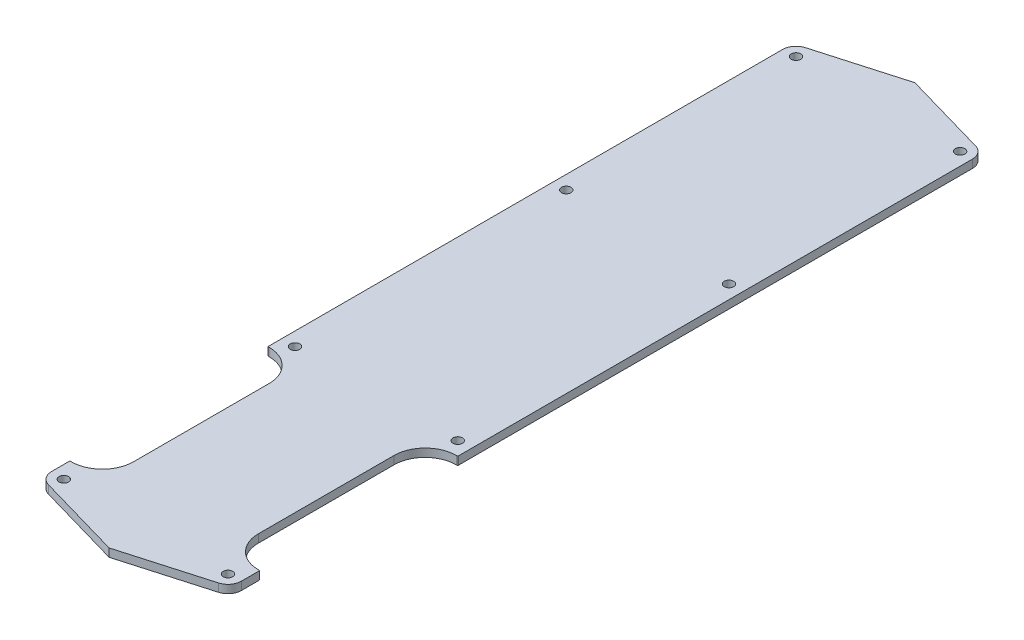
ISO-10303-21;
HEADER;
FILE_DESCRIPTION(('STEP AP214'),'2;1');
FILE_NAME('part.step','',(''),(''),'','','');
FILE_SCHEMA(('AUTOMOTIVE_DESIGN { 1 0 10303 214 1 1 1 1 }'));
ENDSEC;
DATA;
#1=APPLICATION_CONTEXT('core data for automotive mechanical design processes');
#2=APPLICATION_PROTOCOL_DEFINITION('international standard','automotive_design',2000,#1);
#3=PRODUCT_CONTEXT('',#1,'mechanical');
#4=PRODUCT('Part','Part','',(#3));
#5=PRODUCT_RELATED_PRODUCT_CATEGORY('part','',(#4));
#6=PRODUCT_DEFINITION_FORMATION('','',#4);
#7=PRODUCT_DEFINITION_CONTEXT('part definition',#1,'design');
#8=PRODUCT_DEFINITION('design','',#6,#7);
#9=PRODUCT_DEFINITION_SHAPE('','',#8);
#10=(LENGTH_UNIT() NAMED_UNIT(*) SI_UNIT(.MILLI.,.METRE.));
#11=(NAMED_UNIT(*) PLANE_ANGLE_UNIT() SI_UNIT($,.RADIAN.));
#12=(NAMED_UNIT(*) SI_UNIT($,.STERADIAN.) SOLID_ANGLE_UNIT());
#13=UNCERTAINTY_MEASURE_WITH_UNIT(LENGTH_MEASURE(1.E-05),#10,'distance_accuracy_value','');
#14=(GEOMETRIC_REPRESENTATION_CONTEXT(3) GLOBAL_UNCERTAINTY_ASSIGNED_CONTEXT((#13)) GLOBAL_UNIT_ASSIGNED_CONTEXT((#10,
#11,#12)) REPRESENTATION_CONTEXT('',''));
#15=CARTESIAN_POINT('',(0.,0.,0.));
#16=DIRECTION('',(0.,0.,1.));
#17=DIRECTION('',(1.,0.,0.));
#18=AXIS2_PLACEMENT_3D('',#15,#16,#17);
#19=CARTESIAN_POINT('',(-31.378186779085,2.5,-139.538538229178));
#20=DIRECTION('',(-0.275637355817003,0.,-0.961261695938318));
#21=DIRECTION('',(-0.961261695938318,0.,0.275637355817003));
#22=AXIS2_PLACEMENT_3D('',#19,#20,#21);
#23=PLANE('',#22);
#24=DIRECTION('',(0.,-1.,0.));
#25=VECTOR('',#24,1.);
#26=CARTESIAN_POINT('',(-31.378186779085,2.5,-139.538538229178));
#27=LINE('',#26,#25);
#28=CARTESIAN_POINT('',(-31.378186779085,1.5,-139.538538229178));
#29=VERTEX_POINT('',#28);
#30=CARTESIAN_POINT('',(-31.378186779085,-1.5,-139.538538229178));
#31=VERTEX_POINT('',#30);
#32=EDGE_CURVE('E11',#29,#31,#27,.T.);
#33=ORIENTED_EDGE('',*,*,#32,.F.);
#34=DIRECTION('',(0.961261695938318,0.,-0.275637355817003));
#35=VECTOR('',#34,1.);
#36=CARTESIAN_POINT('',(-31.378186779085,1.5,-139.538538229178));
#37=LINE('',#36,#35);
#38=CARTESIAN_POINT('',(0.,1.5,-148.536088501558));
#39=VERTEX_POINT('',#38);
#40=EDGE_CURVE('E191',#29,#39,#37,.T.);
#41=ORIENTED_EDGE('',*,*,#40,.T.);
#42=DIRECTION('',(0.,-1.,0.));
#43=VECTOR('',#42,1.);
#44=CARTESIAN_POINT('',(0.,2.5,-148.536088501558));
#45=LINE('',#44,#43);
#46=CARTESIAN_POINT('',(0.,-1.5,-148.536088501558));
#47=VERTEX_POINT('',#46);
#48=EDGE_CURVE('E198',#39,#47,#45,.T.);
#49=ORIENTED_EDGE('',*,*,#48,.T.);
#50=DIRECTION('',(0.961261695938318,0.,-0.275637355817003));
#51=VECTOR('',#50,1.);
#52=CARTESIAN_POINT('',(-31.378186779085,-1.5,-139.538538229178));
#53=LINE('',#52,#51);
#54=EDGE_CURVE('E310',#31,#47,#53,.T.);
#55=ORIENTED_EDGE('',*,*,#54,.F.);
#56=EDGE_LOOP('',(#33,#41,#49,#55));
#57=FACE_BOUND('',#56,.T.);
#58=ADVANCED_FACE('F38',(#57),#23,.T.);
#59=CARTESIAN_POINT('',(-30.,2.5,-134.732229749486));
#60=DIRECTION('',(0.,-1.,0.));
#61=DIRECTION('',(0.,0.,-1.));
#62=AXIS2_PLACEMENT_3D('',#59,#60,#61);
#63=CYLINDRICAL_SURFACE('',#62,5.00000000000001);
#64=DIRECTION('',(0.,-1.,0.));
#65=VECTOR('',#64,1.);
#66=CARTESIAN_POINT('',(-35.,2.5,-134.732229749486));
#67=LINE('',#66,#65);
#68=CARTESIAN_POINT('',(-35.,1.5,-134.732229749486));
#69=VERTEX_POINT('',#68);
#70=CARTESIAN_POINT('',(-35.,-1.5,-134.732229749486));
#71=VERTEX_POINT('',#70);
#72=EDGE_CURVE('E46',#69,#71,#67,.T.);
#73=ORIENTED_EDGE('',*,*,#72,.F.);
#74=CARTESIAN_POINT('',(-30.,1.5,-134.732229749486));
#75=DIRECTION('',(0.,1.,0.));
#76=DIRECTION('',(0.,0.,1.));
#77=AXIS2_PLACEMENT_3D('',#74,#75,#76);
#78=CIRCLE('',#77,5.00000000000001);
#79=EDGE_CURVE('E201',#69,#29,#78,.F.);
#80=ORIENTED_EDGE('',*,*,#79,.T.);
#81=ORIENTED_EDGE('',*,*,#32,.T.);
#82=CARTESIAN_POINT('',(-30.,-1.5,-134.732229749486));
#83=DIRECTION('',(0.,-1.,0.));
#84=DIRECTION('',(0.,0.,-1.));
#85=AXIS2_PLACEMENT_3D('',#82,#83,#84);
#86=CIRCLE('',#85,5.00000000000001);
#87=EDGE_CURVE('E208',#71,#31,#86,.T.);
#88=ORIENTED_EDGE('',*,*,#87,.F.);
#89=EDGE_LOOP('',(#73,#80,#81,#88));
#90=FACE_BOUND('',#89,.T.);
#91=ADVANCED_FACE('F430',(#90),#63,.T.);
#92=CARTESIAN_POINT('',(-35.,2.5,55.));
#93=DIRECTION('',(-1.,0.,0.));
#94=DIRECTION('',(0.,0.,1.));
#95=AXIS2_PLACEMENT_3D('',#92,#93,#94);
#96=PLANE('',#95);
#97=DIRECTION('',(0.,-1.,0.));
#98=VECTOR('',#97,1.);
#99=CARTESIAN_POINT('',(-35.,2.5,55.));
#100=LINE('',#99,#98);
#101=CARTESIAN_POINT('',(-35.,1.5,55.));
#102=VERTEX_POINT('',#101);
#103=CARTESIAN_POINT('',(-35.,-1.5,55.));
#104=VERTEX_POINT('',#103);
#105=EDGE_CURVE('E249',#102,#104,#100,.T.);
#106=ORIENTED_EDGE('',*,*,#105,.F.);
#107=DIRECTION('',(0.,0.,-1.));
#108=VECTOR('',#107,1.);
#109=CARTESIAN_POINT('',(-35.,1.5,55.));
#110=LINE('',#109,#108);
#111=EDGE_CURVE('E336',#102,#69,#110,.T.);
#112=ORIENTED_EDGE('',*,*,#111,.T.);
#113=ORIENTED_EDGE('',*,*,#72,.T.);
#114=DIRECTION('',(0.,0.,-1.));
#115=VECTOR('',#114,1.);
#116=CARTESIAN_POINT('',(-35.,-1.5,-128.));
#117=LINE('',#116,#115);
#118=EDGE_CURVE('E212',#104,#71,#117,.T.);
#119=ORIENTED_EDGE('',*,*,#118,.F.);
#120=EDGE_LOOP('',(#106,#112,#113,#119));
#121=FACE_BOUND('',#120,.T.);
#122=ADVANCED_FACE('F434',(#121),#96,.T.);
#123=CARTESIAN_POINT('',(-34.5,2.5,55.));
#124=DIRECTION('',(0.,0.,1.));
#125=DIRECTION('',(1.,0.,0.));
#126=AXIS2_PLACEMENT_3D('',#123,#124,#125);
#127=PLANE('',#126);
#128=DIRECTION('',(0.,-1.,0.));
#129=VECTOR('',#128,1.);
#130=CARTESIAN_POINT('',(-34.5,2.5,55.));
#131=LINE('',#130,#129);
#132=CARTESIAN_POINT('',(-34.5,1.5,55.));
#133=VERTEX_POINT('',#132);
#134=CARTESIAN_POINT('',(-34.5,-1.5,55.));
#135=VERTEX_POINT('',#134);
#136=EDGE_CURVE('E247',#133,#135,#131,.T.);
#137=ORIENTED_EDGE('',*,*,#136,.F.);
#138=DIRECTION('',(-1.,0.,0.));
#139=VECTOR('',#138,1.);
#140=CARTESIAN_POINT('',(-34.5,1.5,55.));
#141=LINE('',#140,#139);
#142=EDGE_CURVE('E338',#133,#102,#141,.T.);
#143=ORIENTED_EDGE('',*,*,#142,.T.);
#144=ORIENTED_EDGE('',*,*,#105,.T.);
#145=DIRECTION('',(-1.,0.,0.));
#146=VECTOR('',#145,1.);
#147=CARTESIAN_POINT('',(-34.5,-1.5,55.));
#148=LINE('',#147,#146);
#149=EDGE_CURVE('E255',#135,#104,#148,.T.);
#150=ORIENTED_EDGE('',*,*,#149,.F.);
#151=EDGE_LOOP('',(#137,#143,#144,#150));
#152=FACE_BOUND('',#151,.T.);
#153=ADVANCED_FACE('F439',(#152),#127,.T.);
#154=CARTESIAN_POINT('',(-34.5,2.5,66.5));
#155=DIRECTION('',(0.,-1.,0.));
#156=DIRECTION('',(0.,0.,-1.));
#157=AXIS2_PLACEMENT_3D('',#154,#155,#156);
#158=CYLINDRICAL_SURFACE('',#157,11.5);
#159=DIRECTION('',(0.,-1.,0.));
#160=VECTOR('',#159,1.);
#161=CARTESIAN_POINT('',(-23.,2.5,66.5));
#162=LINE('',#161,#160);
#163=CARTESIAN_POINT('',(-23.,1.5,66.5));
#164=VERTEX_POINT('',#163);
#165=CARTESIAN_POINT('',(-23.,-1.5,66.5));
#166=VERTEX_POINT('',#165);
#167=EDGE_CURVE('E245',#164,#166,#162,.T.);
#168=ORIENTED_EDGE('',*,*,#167,.F.);
#169=CARTESIAN_POINT('',(-34.5,1.5,66.5));
#170=DIRECTION('',(0.,1.,0.));
#171=DIRECTION('',(0.,0.,1.));
#172=AXIS2_PLACEMENT_3D('',#169,#170,#171);
#173=CIRCLE('',#172,11.5);
#174=EDGE_CURVE('E341',#164,#133,#173,.T.);
#175=ORIENTED_EDGE('',*,*,#174,.T.);
#176=ORIENTED_EDGE('',*,*,#136,.T.);
#177=CARTESIAN_POINT('',(-34.5,-1.5,66.5));
#178=DIRECTION('',(0.,1.,0.));
#179=DIRECTION('',(0.,0.,1.));
#180=AXIS2_PLACEMENT_3D('',#177,#178,#179);
#181=CIRCLE('',#180,11.5);
#182=EDGE_CURVE('E258',#166,#135,#181,.T.);
#183=ORIENTED_EDGE('',*,*,#182,.F.);
#184=EDGE_LOOP('',(#168,#175,#176,#183));
#185=FACE_BOUND('',#184,.T.);
#186=ADVANCED_FACE('F447',(#185),#158,.F.);
#187=CARTESIAN_POINT('',(-23.,2.5,116.5));
#188=DIRECTION('',(-1.,0.,0.));
#189=DIRECTION('',(0.,0.,1.));
#190=AXIS2_PLACEMENT_3D('',#187,#188,#189);
#191=PLANE('',#190);
#192=DIRECTION('',(0.,-1.,0.));
#193=VECTOR('',#192,1.);
#194=CARTESIAN_POINT('',(-23.,2.5,116.5));
#195=LINE('',#194,#193);
#196=CARTESIAN_POINT('',(-23.,1.5,116.5));
#197=VERTEX_POINT('',#196);
#198=CARTESIAN_POINT('',(-23.,-1.5,116.5));
#199=VERTEX_POINT('',#198);
#200=EDGE_CURVE('E243',#197,#199,#195,.T.);
#201=ORIENTED_EDGE('',*,*,#200,.F.);
#202=DIRECTION('',(0.,0.,-1.));
#203=VECTOR('',#202,1.);
#204=CARTESIAN_POINT('',(-23.,1.5,116.5));
#205=LINE('',#204,#203);
#206=EDGE_CURVE('E344',#197,#164,#205,.T.);
#207=ORIENTED_EDGE('',*,*,#206,.T.);
#208=ORIENTED_EDGE('',*,*,#167,.T.);
#209=DIRECTION('',(0.,0.,-1.));
#210=VECTOR('',#209,1.);
#211=CARTESIAN_POINT('',(-23.,-1.5,116.5));
#212=LINE('',#211,#210);
#213=EDGE_CURVE('E261',#199,#166,#212,.T.);
#214=ORIENTED_EDGE('',*,*,#213,.F.);
#215=EDGE_LOOP('',(#201,#207,#208,#214));
#216=FACE_BOUND('',#215,.T.);
#217=ADVANCED_FACE('F451',(#216),#191,.T.);
#218=CARTESIAN_POINT('',(-34.5,2.5,116.5));
#219=DIRECTION('',(0.,-1.,0.));
#220=DIRECTION('',(0.,0.,-1.));
#221=AXIS2_PLACEMENT_3D('',#218,#219,#220);
#222=CYLINDRICAL_SURFACE('',#221,11.5);
#223=DIRECTION('',(0.,-1.,0.));
#224=VECTOR('',#223,1.);
#225=CARTESIAN_POINT('',(-34.5000000000007,2.5,128.));
#226=LINE('',#225,#224);
#227=CARTESIAN_POINT('',(-34.5000000000007,1.5,128.));
#228=VERTEX_POINT('',#227);
#229=CARTESIAN_POINT('',(-34.5000000000007,-1.5,128.));
#230=VERTEX_POINT('',#229);
#231=EDGE_CURVE('E241',#228,#230,#226,.T.);
#232=ORIENTED_EDGE('',*,*,#231,.F.);
#233=CARTESIAN_POINT('',(-34.5,1.5,116.5));
#234=DIRECTION('',(0.,1.,0.));
#235=DIRECTION('',(0.,0.,1.));
#236=AXIS2_PLACEMENT_3D('',#233,#234,#235);
#237=CIRCLE('',#236,11.5);
#238=EDGE_CURVE('E347',#228,#197,#237,.T.);
#239=ORIENTED_EDGE('',*,*,#238,.T.);
#240=ORIENTED_EDGE('',*,*,#200,.T.);
#241=CARTESIAN_POINT('',(-34.5,-1.5,116.5));
#242=DIRECTION('',(0.,1.,0.));
#243=DIRECTION('',(0.,0.,1.));
#244=AXIS2_PLACEMENT_3D('',#241,#242,#243);
#245=CIRCLE('',#244,11.5);
#246=EDGE_CURVE('E264',#230,#199,#245,.T.);
#247=ORIENTED_EDGE('',*,*,#246,.F.);
#248=EDGE_LOOP('',(#232,#239,#240,#247));
#249=FACE_BOUND('',#248,.T.);
#250=ADVANCED_FACE('F455',(#249),#222,.F.);
#251=CARTESIAN_POINT('',(-35.,2.5,128.));
#252=DIRECTION('',(0.,0.,-1.));
#253=DIRECTION('',(-1.,0.,0.));
#254=AXIS2_PLACEMENT_3D('',#251,#252,#253);
#255=PLANE('',#254);
#256=DIRECTION('',(0.,-1.,0.));
#257=VECTOR('',#256,1.);
#258=CARTESIAN_POINT('',(-35.,2.5,128.));
#259=LINE('',#258,#257);
#260=CARTESIAN_POINT('',(-35.,1.5,128.));
#261=VERTEX_POINT('',#260);
#262=CARTESIAN_POINT('',(-35.,-1.5,128.));
#263=VERTEX_POINT('',#262);
#264=EDGE_CURVE('E239',#261,#263,#259,.T.);
#265=ORIENTED_EDGE('',*,*,#264,.F.);
#266=DIRECTION('',(1.,0.,0.));
#267=VECTOR('',#266,1.);
#268=CARTESIAN_POINT('',(-35.,1.5,128.));
#269=LINE('',#268,#267);
#270=EDGE_CURVE('E350',#261,#228,#269,.T.);
#271=ORIENTED_EDGE('',*,*,#270,.T.);
#272=ORIENTED_EDGE('',*,*,#231,.T.);
#273=DIRECTION('',(1.,0.,0.));
#274=VECTOR('',#273,1.);
#275=CARTESIAN_POINT('',(-35.,-1.5,128.));
#276=LINE('',#275,#274);
#277=EDGE_CURVE('E267',#263,#230,#276,.T.);
#278=ORIENTED_EDGE('',*,*,#277,.F.);
#279=EDGE_LOOP('',(#265,#271,#272,#278));
#280=FACE_BOUND('',#279,.T.);
#281=ADVANCED_FACE('F459',(#280),#255,.T.);
#282=CARTESIAN_POINT('',(-35.,2.5,134.732229749486));
#283=DIRECTION('',(-1.,0.,0.));
#284=DIRECTION('',(0.,0.,1.));
#285=AXIS2_PLACEMENT_3D('',#282,#283,#284);
#286=PLANE('',#285);
#287=DIRECTION('',(0.,-1.,0.));
#288=VECTOR('',#287,1.);
#289=CARTESIAN_POINT('',(-35.,2.5,134.732229749486));
#290=LINE('',#289,#288);
#291=CARTESIAN_POINT('',(-35.,1.5,134.732229749486));
#292=VERTEX_POINT('',#291);
#293=CARTESIAN_POINT('',(-35.,-1.5,134.732229749486));
#294=VERTEX_POINT('',#293);
#295=EDGE_CURVE('E237',#292,#294,#290,.T.);
#296=ORIENTED_EDGE('',*,*,#295,.F.);
#297=DIRECTION('',(0.,0.,-1.));
#298=VECTOR('',#297,1.);
#299=CARTESIAN_POINT('',(-35.,1.5,134.732229749486));
#300=LINE('',#299,#298);
#301=EDGE_CURVE('E353',#292,#261,#300,.T.);
#302=ORIENTED_EDGE('',*,*,#301,.T.);
#303=ORIENTED_EDGE('',*,*,#264,.T.);
#304=DIRECTION('',(0.,0.,-1.));
#305=VECTOR('',#304,1.);
#306=CARTESIAN_POINT('',(-35.,-1.5,134.732229749486));
#307=LINE('',#306,#305);
#308=EDGE_CURVE('E270',#294,#263,#307,.T.);
#309=ORIENTED_EDGE('',*,*,#308,.F.);
#310=EDGE_LOOP('',(#296,#302,#303,#309));
#311=FACE_BOUND('',#310,.T.);
#312=ADVANCED_FACE('F463',(#311),#286,.T.);
#313=CARTESIAN_POINT('',(-30.,2.5,134.732229749486));
#314=DIRECTION('',(0.,-1.,0.));
#315=DIRECTION('',(0.,0.,-1.));
#316=AXIS2_PLACEMENT_3D('',#313,#314,#315);
#317=CYLINDRICAL_SURFACE('',#316,5.00000000000001);
#318=DIRECTION('',(0.,-1.,0.));
#319=VECTOR('',#318,1.);
#320=CARTESIAN_POINT('',(-31.378186779085,2.5,139.538538229178));
#321=LINE('',#320,#319);
#322=CARTESIAN_POINT('',(-31.378186779085,1.5,139.538538229178));
#323=VERTEX_POINT('',#322);
#324=CARTESIAN_POINT('',(-31.378186779085,-1.5,139.538538229178));
#325=VERTEX_POINT('',#324);
#326=EDGE_CURVE('E235',#323,#325,#321,.T.);
#327=ORIENTED_EDGE('',*,*,#326,.F.);
#328=CARTESIAN_POINT('',(-30.,1.5,134.732229749486));
#329=DIRECTION('',(0.,1.,0.));
#330=DIRECTION('',(0.,0.,1.));
#331=AXIS2_PLACEMENT_3D('',#328,#329,#330);
#332=CIRCLE('',#331,5.00000000000001);
#333=EDGE_CURVE('E356',#323,#292,#332,.F.);
#334=ORIENTED_EDGE('',*,*,#333,.T.);
#335=ORIENTED_EDGE('',*,*,#295,.T.);
#336=CARTESIAN_POINT('',(-30.,-1.5,134.732229749486));
#337=DIRECTION('',(0.,-1.,0.));
#338=DIRECTION('',(0.,0.,-1.));
#339=AXIS2_PLACEMENT_3D('',#336,#337,#338);
#340=CIRCLE('',#339,5.00000000000001);
#341=EDGE_CURVE('E273',#325,#294,#340,.T.);
#342=ORIENTED_EDGE('',*,*,#341,.F.);
#343=EDGE_LOOP('',(#327,#334,#335,#342));
#344=FACE_BOUND('',#343,.T.);
#345=ADVANCED_FACE('F467',(#344),#317,.T.);
#346=CARTESIAN_POINT('',(0.,2.5,148.536088501558));
#347=DIRECTION('',(-0.275637355817003,0.,0.961261695938318));
#348=DIRECTION('',(0.961261695938318,0.,0.275637355817003));
#349=AXIS2_PLACEMENT_3D('',#346,#347,#348);
#350=PLANE('',#349);
#351=DIRECTION('',(0.,-1.,0.));
#352=VECTOR('',#351,1.);
#353=CARTESIAN_POINT('',(0.,2.5,148.536088501558));
#354=LINE('',#353,#352);
#355=CARTESIAN_POINT('',(0.,1.5,148.536088501558));
#356=VERTEX_POINT('',#355);
#357=CARTESIAN_POINT('',(0.,-1.5,148.536088501558));
#358=VERTEX_POINT('',#357);
#359=EDGE_CURVE('E233',#356,#358,#354,.T.);
#360=ORIENTED_EDGE('',*,*,#359,.F.);
#361=DIRECTION('',(-0.961261695938318,0.,-0.275637355817003));
#362=VECTOR('',#361,1.);
#363=CARTESIAN_POINT('',(0.,1.5,148.536088501558));
#364=LINE('',#363,#362);
#365=EDGE_CURVE('E359',#356,#323,#364,.T.);
#366=ORIENTED_EDGE('',*,*,#365,.T.);
#367=ORIENTED_EDGE('',*,*,#326,.T.);
#368=DIRECTION('',(-0.961261695938318,0.,-0.275637355817003));
#369=VECTOR('',#368,1.);
#370=CARTESIAN_POINT('',(0.,-1.5,148.536088501558));
#371=LINE('',#370,#369);
#372=EDGE_CURVE('E276',#358,#325,#371,.T.);
#373=ORIENTED_EDGE('',*,*,#372,.F.);
#374=EDGE_LOOP('',(#360,#366,#367,#373));
#375=FACE_BOUND('',#374,.T.);
#376=ADVANCED_FACE('F471',(#375),#350,.T.);
#377=CARTESIAN_POINT('',(31.378186779085,2.5,139.538538229178));
#378=DIRECTION('',(0.275637355817003,0.,0.961261695938318));
#379=DIRECTION('',(0.961261695938318,0.,-0.275637355817003));
#380=AXIS2_PLACEMENT_3D('',#377,#378,#379);
#381=PLANE('',#380);
#382=DIRECTION('',(0.,-1.,0.));
#383=VECTOR('',#382,1.);
#384=CARTESIAN_POINT('',(31.378186779085,2.5,139.538538229178));
#385=LINE('',#384,#383);
#386=CARTESIAN_POINT('',(31.378186779085,1.5,139.538538229178));
#387=VERTEX_POINT('',#386);
#388=CARTESIAN_POINT('',(31.378186779085,-1.5,139.538538229178));
#389=VERTEX_POINT('',#388);
#390=EDGE_CURVE('E231',#387,#389,#385,.T.);
#391=ORIENTED_EDGE('',*,*,#390,.F.);
#392=DIRECTION('',(-0.961261695938318,0.,0.275637355817003));
#393=VECTOR('',#392,1.);
#394=CARTESIAN_POINT('',(31.378186779085,1.5,139.538538229178));
#395=LINE('',#394,#393);
#396=EDGE_CURVE('E362',#387,#356,#395,.T.);
#397=ORIENTED_EDGE('',*,*,#396,.T.);
#398=ORIENTED_EDGE('',*,*,#359,.T.);
#399=DIRECTION('',(-0.961261695938318,0.,0.275637355817003));
#400=VECTOR('',#399,1.);
#401=CARTESIAN_POINT('',(31.378186779085,-1.5,139.538538229178));
#402=LINE('',#401,#400);
#403=EDGE_CURVE('E279',#389,#358,#402,.T.);
#404=ORIENTED_EDGE('',*,*,#403,.F.);
#405=EDGE_LOOP('',(#391,#397,#398,#404));
#406=FACE_BOUND('',#405,.T.);
#407=ADVANCED_FACE('F475',(#406),#381,.T.);
#408=CARTESIAN_POINT('',(30.,2.5,134.732229749486));
#409=DIRECTION('',(0.,-1.,0.));
#410=DIRECTION('',(0.,0.,-1.));
#411=AXIS2_PLACEMENT_3D('',#408,#409,#410);
#412=CYLINDRICAL_SURFACE('',#411,5.00000000000001);
#413=DIRECTION('',(0.,-1.,0.));
#414=VECTOR('',#413,1.);
#415=CARTESIAN_POINT('',(35.,2.5,134.732229749486));
#416=LINE('',#415,#414);
#417=CARTESIAN_POINT('',(35.,1.5,134.732229749486));
#418=VERTEX_POINT('',#417);
#419=CARTESIAN_POINT('',(35.,-1.5,134.732229749486));
#420=VERTEX_POINT('',#419);
#421=EDGE_CURVE('E229',#418,#420,#416,.T.);
#422=ORIENTED_EDGE('',*,*,#421,.F.);
#423=CARTESIAN_POINT('',(30.,1.5,134.732229749486));
#424=DIRECTION('',(0.,1.,0.));
#425=DIRECTION('',(0.,0.,1.));
#426=AXIS2_PLACEMENT_3D('',#423,#424,#425);
#427=CIRCLE('',#426,5.00000000000001);
#428=EDGE_CURVE('E365',#418,#387,#427,.F.);
#429=ORIENTED_EDGE('',*,*,#428,.T.);
#430=ORIENTED_EDGE('',*,*,#390,.T.);
#431=CARTESIAN_POINT('',(30.,-1.5,134.732229749486));
#432=DIRECTION('',(0.,-1.,0.));
#433=DIRECTION('',(0.,0.,-1.));
#434=AXIS2_PLACEMENT_3D('',#431,#432,#433);
#435=CIRCLE('',#434,5.00000000000001);
#436=EDGE_CURVE('E282',#420,#389,#435,.T.);
#437=ORIENTED_EDGE('',*,*,#436,.F.);
#438=EDGE_LOOP('',(#422,#429,#430,#437));
#439=FACE_BOUND('',#438,.T.);
#440=ADVANCED_FACE('F479',(#439),#412,.T.);
#441=CARTESIAN_POINT('',(35.,2.5,128.));
#442=DIRECTION('',(1.,0.,0.));
#443=DIRECTION('',(0.,0.,-1.));
#444=AXIS2_PLACEMENT_3D('',#441,#442,#443);
#445=PLANE('',#444);
#446=DIRECTION('',(0.,-1.,0.));
#447=VECTOR('',#446,1.);
#448=CARTESIAN_POINT('',(35.,2.5,128.));
#449=LINE('',#448,#447);
#450=CARTESIAN_POINT('',(35.,1.5,128.));
#451=VERTEX_POINT('',#450);
#452=CARTESIAN_POINT('',(35.,-1.5,128.));
#453=VERTEX_POINT('',#452);
#454=EDGE_CURVE('E227',#451,#453,#449,.T.);
#455=ORIENTED_EDGE('',*,*,#454,.F.);
#456=DIRECTION('',(0.,0.,1.));
#457=VECTOR('',#456,1.);
#458=CARTESIAN_POINT('',(35.,1.5,128.));
#459=LINE('',#458,#457);
#460=EDGE_CURVE('E368',#451,#418,#459,.T.);
#461=ORIENTED_EDGE('',*,*,#460,.T.);
#462=ORIENTED_EDGE('',*,*,#421,.T.);
#463=DIRECTION('',(0.,0.,1.));
#464=VECTOR('',#463,1.);
#465=CARTESIAN_POINT('',(35.,-1.5,128.));
#466=LINE('',#465,#464);
#467=EDGE_CURVE('E285',#453,#420,#466,.T.);
#468=ORIENTED_EDGE('',*,*,#467,.F.);
#469=EDGE_LOOP('',(#455,#461,#462,#468));
#470=FACE_BOUND('',#469,.T.);
#471=ADVANCED_FACE('F483',(#470),#445,.T.);
#472=CARTESIAN_POINT('',(34.5000000000007,2.5,128.));
#473=DIRECTION('',(0.,0.,-1.));
#474=DIRECTION('',(-1.,0.,0.));
#475=AXIS2_PLACEMENT_3D('',#472,#473,#474);
#476=PLANE('',#475);
#477=DIRECTION('',(0.,-1.,0.));
#478=VECTOR('',#477,1.);
#479=CARTESIAN_POINT('',(34.5,2.5,128.));
#480=LINE('',#479,#478);
#481=CARTESIAN_POINT('',(34.5,1.5,128.));
#482=VERTEX_POINT('',#481);
#483=CARTESIAN_POINT('',(34.5,-1.5,128.));
#484=VERTEX_POINT('',#483);
#485=EDGE_CURVE('E225',#482,#484,#480,.T.);
#486=ORIENTED_EDGE('',*,*,#485,.F.);
#487=DIRECTION('',(1.,0.,0.));
#488=VECTOR('',#487,1.);
#489=CARTESIAN_POINT('',(34.5000000000007,1.5,128.));
#490=LINE('',#489,#488);
#491=EDGE_CURVE('E371',#482,#451,#490,.T.);
#492=ORIENTED_EDGE('',*,*,#491,.T.);
#493=ORIENTED_EDGE('',*,*,#454,.T.);
#494=DIRECTION('',(1.,0.,0.));
#495=VECTOR('',#494,1.);
#496=CARTESIAN_POINT('',(34.5000000000007,-1.5,128.));
#497=LINE('',#496,#495);
#498=EDGE_CURVE('E288',#484,#453,#497,.T.);
#499=ORIENTED_EDGE('',*,*,#498,.F.);
#500=EDGE_LOOP('',(#486,#492,#493,#499));
#501=FACE_BOUND('',#500,.T.);
#502=ADVANCED_FACE('F487',(#501),#476,.T.);
#503=CARTESIAN_POINT('',(34.5,2.5,116.5));
#504=DIRECTION('',(0.,-1.,0.));
#505=DIRECTION('',(0.,0.,-1.));
#506=AXIS2_PLACEMENT_3D('',#503,#504,#505);
#507=CYLINDRICAL_SURFACE('',#506,11.5);
#508=DIRECTION('',(0.,-1.,0.));
#509=VECTOR('',#508,1.);
#510=CARTESIAN_POINT('',(23.,2.5,116.5));
#511=LINE('',#510,#509);
#512=CARTESIAN_POINT('',(23.,1.5,116.5));
#513=VERTEX_POINT('',#512);
#514=CARTESIAN_POINT('',(23.,-1.5,116.5));
#515=VERTEX_POINT('',#514);
#516=EDGE_CURVE('E223',#513,#515,#511,.T.);
#517=ORIENTED_EDGE('',*,*,#516,.F.);
#518=CARTESIAN_POINT('',(34.5,1.5,116.5));
#519=DIRECTION('',(0.,1.,0.));
#520=DIRECTION('',(0.,0.,1.));
#521=AXIS2_PLACEMENT_3D('',#518,#519,#520);
#522=CIRCLE('',#521,11.5);
#523=EDGE_CURVE('E374',#513,#482,#522,.T.);
#524=ORIENTED_EDGE('',*,*,#523,.T.);
#525=ORIENTED_EDGE('',*,*,#485,.T.);
#526=CARTESIAN_POINT('',(34.5,-1.5,116.5));
#527=DIRECTION('',(0.,1.,0.));
#528=DIRECTION('',(0.,0.,1.));
#529=AXIS2_PLACEMENT_3D('',#526,#527,#528);
#530=CIRCLE('',#529,11.5);
#531=EDGE_CURVE('E291',#515,#484,#530,.T.);
#532=ORIENTED_EDGE('',*,*,#531,.F.);
#533=EDGE_LOOP('',(#517,#524,#525,#532));
#534=FACE_BOUND('',#533,.T.);
#535=ADVANCED_FACE('F491',(#534),#507,.F.);
#536=CARTESIAN_POINT('',(23.,2.5,66.5));
#537=DIRECTION('',(1.,0.,0.));
#538=DIRECTION('',(0.,0.,-1.));
#539=AXIS2_PLACEMENT_3D('',#536,#537,#538);
#540=PLANE('',#539);
#541=DIRECTION('',(0.,-1.,0.));
#542=VECTOR('',#541,1.);
#543=CARTESIAN_POINT('',(23.,2.5,66.5));
#544=LINE('',#543,#542);
#545=CARTESIAN_POINT('',(23.,1.5,66.5));
#546=VERTEX_POINT('',#545);
#547=CARTESIAN_POINT('',(23.,-1.5,66.5));
#548=VERTEX_POINT('',#547);
#549=EDGE_CURVE('E221',#546,#548,#544,.T.);
#550=ORIENTED_EDGE('',*,*,#549,.F.);
#551=DIRECTION('',(0.,0.,1.));
#552=VECTOR('',#551,1.);
#553=CARTESIAN_POINT('',(23.,1.5,66.5));
#554=LINE('',#553,#552);
#555=EDGE_CURVE('E377',#546,#513,#554,.T.);
#556=ORIENTED_EDGE('',*,*,#555,.T.);
#557=ORIENTED_EDGE('',*,*,#516,.T.);
#558=DIRECTION('',(0.,0.,1.));
#559=VECTOR('',#558,1.);
#560=CARTESIAN_POINT('',(23.,-1.5,66.5));
#561=LINE('',#560,#559);
#562=EDGE_CURVE('E294',#548,#515,#561,.T.);
#563=ORIENTED_EDGE('',*,*,#562,.F.);
#564=EDGE_LOOP('',(#550,#556,#557,#563));
#565=FACE_BOUND('',#564,.T.);
#566=ADVANCED_FACE('F495',(#565),#540,.T.);
#567=CARTESIAN_POINT('',(34.5,2.5,66.5));
#568=DIRECTION('',(0.,-1.,0.));
#569=DIRECTION('',(0.,0.,-1.));
#570=AXIS2_PLACEMENT_3D('',#567,#568,#569);
#571=CYLINDRICAL_SURFACE('',#570,11.5);
#572=DIRECTION('',(0.,-1.,0.));
#573=VECTOR('',#572,1.);
#574=CARTESIAN_POINT('',(34.5000000000013,2.5,55.));
#575=LINE('',#574,#573);
#576=CARTESIAN_POINT('',(34.5000000000013,1.5,55.));
#577=VERTEX_POINT('',#576);
#578=CARTESIAN_POINT('',(34.5000000000013,-1.5,55.));
#579=VERTEX_POINT('',#578);
#580=EDGE_CURVE('E219',#577,#579,#575,.T.);
#581=ORIENTED_EDGE('',*,*,#580,.F.);
#582=CARTESIAN_POINT('',(34.5,1.5,66.5));
#583=DIRECTION('',(0.,1.,0.));
#584=DIRECTION('',(0.,0.,1.));
#585=AXIS2_PLACEMENT_3D('',#582,#583,#584);
#586=CIRCLE('',#585,11.5);
#587=EDGE_CURVE('E380',#577,#546,#586,.T.);
#588=ORIENTED_EDGE('',*,*,#587,.T.);
#589=ORIENTED_EDGE('',*,*,#549,.T.);
#590=CARTESIAN_POINT('',(34.5,-1.5,66.5));
#591=DIRECTION('',(0.,1.,0.));
#592=DIRECTION('',(0.,0.,1.));
#593=AXIS2_PLACEMENT_3D('',#590,#591,#592);
#594=CIRCLE('',#593,11.5);
#595=EDGE_CURVE('E297',#579,#548,#594,.T.);
#596=ORIENTED_EDGE('',*,*,#595,.F.);
#597=EDGE_LOOP('',(#581,#588,#589,#596));
#598=FACE_BOUND('',#597,.T.);
#599=ADVANCED_FACE('F499',(#598),#571,.F.);
#600=CARTESIAN_POINT('',(35.,2.5,55.));
#601=DIRECTION('',(0.,0.,1.));
#602=DIRECTION('',(1.,0.,0.));
#603=AXIS2_PLACEMENT_3D('',#600,#601,#602);
#604=PLANE('',#603);
#605=DIRECTION('',(0.,-1.,0.));
#606=VECTOR('',#605,1.);
#607=CARTESIAN_POINT('',(35.,2.5,55.));
#608=LINE('',#607,#606);
#609=CARTESIAN_POINT('',(35.,1.5,55.));
#610=VERTEX_POINT('',#609);
#611=CARTESIAN_POINT('',(35.,-1.5,55.));
#612=VERTEX_POINT('',#611);
#613=EDGE_CURVE('E217',#610,#612,#608,.T.);
#614=ORIENTED_EDGE('',*,*,#613,.F.);
#615=DIRECTION('',(-1.,0.,0.));
#616=VECTOR('',#615,1.);
#617=CARTESIAN_POINT('',(35.,1.5,55.));
#618=LINE('',#617,#616);
#619=EDGE_CURVE('E383',#610,#577,#618,.T.);
#620=ORIENTED_EDGE('',*,*,#619,.T.);
#621=ORIENTED_EDGE('',*,*,#580,.T.);
#622=DIRECTION('',(-1.,0.,0.));
#623=VECTOR('',#622,1.);
#624=CARTESIAN_POINT('',(35.,-1.5,55.));
#625=LINE('',#624,#623);
#626=EDGE_CURVE('E300',#612,#579,#625,.T.);
#627=ORIENTED_EDGE('',*,*,#626,.F.);
#628=EDGE_LOOP('',(#614,#620,#621,#627));
#629=FACE_BOUND('',#628,.T.);
#630=ADVANCED_FACE('F503',(#629),#604,.T.);
#631=CARTESIAN_POINT('',(35.,2.5,-134.732229749486));
#632=DIRECTION('',(1.,0.,0.));
#633=DIRECTION('',(0.,0.,-1.));
#634=AXIS2_PLACEMENT_3D('',#631,#632,#633);
#635=PLANE('',#634);
#636=DIRECTION('',(0.,-1.,0.));
#637=VECTOR('',#636,1.);
#638=CARTESIAN_POINT('',(35.,2.5,-134.732229749486));
#639=LINE('',#638,#637);
#640=CARTESIAN_POINT('',(35.,1.5,-134.732229749486));
#641=VERTEX_POINT('',#640);
#642=CARTESIAN_POINT('',(35.,-1.5,-134.732229749486));
#643=VERTEX_POINT('',#642);
#644=EDGE_CURVE('E209',#641,#643,#639,.T.);
#645=ORIENTED_EDGE('',*,*,#644,.F.);
#646=DIRECTION('',(0.,0.,1.));
#647=VECTOR('',#646,1.);
#648=CARTESIAN_POINT('',(35.,1.5,-134.732229749486));
#649=LINE('',#648,#647);
#650=EDGE_CURVE('E386',#641,#610,#649,.T.);
#651=ORIENTED_EDGE('',*,*,#650,.T.);
#652=ORIENTED_EDGE('',*,*,#613,.T.);
#653=DIRECTION('',(0.,0.,1.));
#654=VECTOR('',#653,1.);
#655=CARTESIAN_POINT('',(35.,-1.5,-55.));
#656=LINE('',#655,#654);
#657=EDGE_CURVE('E303',#643,#612,#656,.T.);
#658=ORIENTED_EDGE('',*,*,#657,.F.);
#659=EDGE_LOOP('',(#645,#651,#652,#658));
#660=FACE_BOUND('',#659,.T.);
#661=ADVANCED_FACE('F507',(#660),#635,.T.);
#662=CARTESIAN_POINT('',(30.,2.5,-134.732229749486));
#663=DIRECTION('',(0.,-1.,0.));
#664=DIRECTION('',(0.,0.,-1.));
#665=AXIS2_PLACEMENT_3D('',#662,#663,#664);
#666=CYLINDRICAL_SURFACE('',#665,5.00000000000001);
#667=DIRECTION('',(0.,-1.,0.));
#668=VECTOR('',#667,1.);
#669=CARTESIAN_POINT('',(31.378186779085,2.5,-139.538538229178));
#670=LINE('',#669,#668);
#671=CARTESIAN_POINT('',(31.378186779085,1.5,-139.538538229178));
#672=VERTEX_POINT('',#671);
#673=CARTESIAN_POINT('',(31.378186779085,-1.5,-139.538538229178));
#674=VERTEX_POINT('',#673);
#675=EDGE_CURVE('E207',#672,#674,#670,.T.);
#676=ORIENTED_EDGE('',*,*,#675,.F.);
#677=CARTESIAN_POINT('',(30.,1.5,-134.732229749486));
#678=DIRECTION('',(0.,1.,0.));
#679=DIRECTION('',(0.,0.,1.));
#680=AXIS2_PLACEMENT_3D('',#677,#678,#679);
#681=CIRCLE('',#680,5.00000000000001);
#682=EDGE_CURVE('E54',#672,#641,#681,.F.);
#683=ORIENTED_EDGE('',*,*,#682,.T.);
#684=ORIENTED_EDGE('',*,*,#644,.T.);
#685=CARTESIAN_POINT('',(30.,-1.5,-134.732229749486));
#686=DIRECTION('',(0.,-1.,0.));
#687=DIRECTION('',(0.,0.,-1.));
#688=AXIS2_PLACEMENT_3D('',#685,#686,#687);
#689=CIRCLE('',#688,5.00000000000001);
#690=EDGE_CURVE('E306',#674,#643,#689,.T.);
#691=ORIENTED_EDGE('',*,*,#690,.F.);
#692=EDGE_LOOP('',(#676,#683,#684,#691));
#693=FACE_BOUND('',#692,.T.);
#694=ADVANCED_FACE('F511',(#693),#666,.T.);
#695=CARTESIAN_POINT('',(0.,2.5,-148.536088501558));
#696=DIRECTION('',(0.275637355817003,0.,-0.961261695938318));
#697=DIRECTION('',(-0.961261695938318,0.,-0.275637355817003));
#698=AXIS2_PLACEMENT_3D('',#695,#696,#697);
#699=PLANE('',#698);
#700=ORIENTED_EDGE('',*,*,#48,.F.);
#701=DIRECTION('',(0.961261695938318,0.,0.275637355817003));
#702=VECTOR('',#701,1.);
#703=CARTESIAN_POINT('',(0.,1.5,-148.536088501558));
#704=LINE('',#703,#702);
#705=EDGE_CURVE('E185',#39,#672,#704,.T.);
#706=ORIENTED_EDGE('',*,*,#705,.T.);
#707=ORIENTED_EDGE('',*,*,#675,.T.);
#708=DIRECTION('',(0.961261695938318,0.,0.275637355817003));
#709=VECTOR('',#708,1.);
#710=CARTESIAN_POINT('',(0.,-1.5,-148.536088501558));
#711=LINE('',#710,#709);
#712=EDGE_CURVE('E205',#47,#674,#711,.T.);
#713=ORIENTED_EDGE('',*,*,#712,.F.);
#714=EDGE_LOOP('',(#700,#706,#707,#713));
#715=FACE_BOUND('',#714,.T.);
#716=ADVANCED_FACE('F203',(#715),#699,.T.);
#717=CARTESIAN_POINT('',(-30.25,2.5,134.954028797882));
#718=DIRECTION('',(0.,-1.,0.));
#719=DIRECTION('',(0.,0.,-1.));
#720=AXIS2_PLACEMENT_3D('',#717,#718,#719);
#721=CYLINDRICAL_SURFACE('',#720,1.75);
#722=CARTESIAN_POINT('',(-30.25,-1.5,134.954028797882));
#723=DIRECTION('',(0.,-1.,0.));
#724=DIRECTION('',(0.,0.,1.));
#725=AXIS2_PLACEMENT_3D('',#722,#723,#724);
#726=CIRCLE('',#725,1.75);
#727=CARTESIAN_POINT('',(-30.25,-1.5,136.704028797882));
#728=VERTEX_POINT('',#727);
#729=EDGE_CURVE('E312',#728,#728,#726,.T.);
#730=ORIENTED_EDGE('',*,*,#729,.T.);
#731=EDGE_LOOP('',(#730));
#732=FACE_BOUND('',#731,.T.);
#733=CARTESIAN_POINT('',(-30.25,1.5,134.954028797882));
#734=DIRECTION('',(0.,1.,0.));
#735=DIRECTION('',(0.,0.,1.));
#736=AXIS2_PLACEMENT_3D('',#733,#734,#735);
#737=CIRCLE('',#736,1.75);
#738=CARTESIAN_POINT('',(-30.25,1.5,136.704028797882));
#739=VERTEX_POINT('',#738);
#740=EDGE_CURVE('E195',#739,#739,#737,.F.);
#741=ORIENTED_EDGE('',*,*,#740,.F.);
#742=EDGE_LOOP('',(#741));
#743=FACE_BOUND('',#742,.T.);
#744=ADVANCED_FACE('F516',(#732,#743),#721,.F.);
#745=CARTESIAN_POINT('',(30.,2.5,-50.));
#746=DIRECTION('',(0.,-1.,0.));
#747=DIRECTION('',(0.,0.,-1.));
#748=AXIS2_PLACEMENT_3D('',#745,#746,#747);
#749=CYLINDRICAL_SURFACE('',#748,1.75);
#750=CARTESIAN_POINT('',(30.,-1.5,-50.));
#751=DIRECTION('',(0.,-1.,0.));
#752=DIRECTION('',(0.,0.,1.));
#753=AXIS2_PLACEMENT_3D('',#750,#751,#752);
#754=CIRCLE('',#753,1.75);
#755=CARTESIAN_POINT('',(30.,-1.5,-48.25));
#756=VERTEX_POINT('',#755);
#757=EDGE_CURVE('E315',#756,#756,#754,.T.);
#758=ORIENTED_EDGE('',*,*,#757,.T.);
#759=EDGE_LOOP('',(#758));
#760=FACE_BOUND('',#759,.T.);
#761=CARTESIAN_POINT('',(30.,1.5,-50.));
#762=DIRECTION('',(0.,1.,0.));
#763=DIRECTION('',(0.,0.,1.));
#764=AXIS2_PLACEMENT_3D('',#761,#762,#763);
#765=CIRCLE('',#764,1.75);
#766=CARTESIAN_POINT('',(30.,1.5,-48.25));
#767=VERTEX_POINT('',#766);
#768=EDGE_CURVE('E391',#767,#767,#765,.F.);
#769=ORIENTED_EDGE('',*,*,#768,.F.);
#770=EDGE_LOOP('',(#769));
#771=FACE_BOUND('',#770,.T.);
#772=ADVANCED_FACE('F520',(#760,#771),#749,.F.);
#773=CARTESIAN_POINT('',(-29.9999999999997,2.5,50.));
#774=DIRECTION('',(0.,-1.,0.));
#775=DIRECTION('',(0.,0.,-1.));
#776=AXIS2_PLACEMENT_3D('',#773,#774,#775);
#777=CYLINDRICAL_SURFACE('',#776,1.75);
#778=CARTESIAN_POINT('',(-29.9999999999997,-1.5,50.));
#779=DIRECTION('',(0.,-1.,0.));
#780=DIRECTION('',(0.,0.,1.));
#781=AXIS2_PLACEMENT_3D('',#778,#779,#780);
#782=CIRCLE('',#781,1.75);
#783=CARTESIAN_POINT('',(-29.9999999999997,-1.5,51.75));
#784=VERTEX_POINT('',#783);
#785=EDGE_CURVE('E318',#784,#784,#782,.T.);
#786=ORIENTED_EDGE('',*,*,#785,.T.);
#787=EDGE_LOOP('',(#786));
#788=FACE_BOUND('',#787,.T.);
#789=CARTESIAN_POINT('',(-29.9999999999997,1.5,50.));
#790=DIRECTION('',(0.,1.,0.));
#791=DIRECTION('',(0.,0.,1.));
#792=AXIS2_PLACEMENT_3D('',#789,#790,#791);
#793=CIRCLE('',#792,1.75);
#794=CARTESIAN_POINT('',(-29.9999999999997,1.5,51.75));
#795=VERTEX_POINT('',#794);
#796=EDGE_CURVE('E394',#795,#795,#793,.F.);
#797=ORIENTED_EDGE('',*,*,#796,.F.);
#798=EDGE_LOOP('',(#797));
#799=FACE_BOUND('',#798,.T.);
#800=ADVANCED_FACE('F525',(#788,#799),#777,.F.);
#801=CARTESIAN_POINT('',(30.,2.5,50.));
#802=DIRECTION('',(0.,-1.,0.));
#803=DIRECTION('',(0.,0.,-1.));
#804=AXIS2_PLACEMENT_3D('',#801,#802,#803);
#805=CYLINDRICAL_SURFACE('',#804,1.75);
#806=CARTESIAN_POINT('',(30.,-1.5,50.));
#807=DIRECTION('',(0.,-1.,0.));
#808=DIRECTION('',(0.,0.,1.));
#809=AXIS2_PLACEMENT_3D('',#806,#807,#808);
#810=CIRCLE('',#809,1.75);
#811=CARTESIAN_POINT('',(30.,-1.5,51.75));
#812=VERTEX_POINT('',#811);
#813=EDGE_CURVE('E321',#812,#812,#810,.T.);
#814=ORIENTED_EDGE('',*,*,#813,.T.);
#815=EDGE_LOOP('',(#814));
#816=FACE_BOUND('',#815,.T.);
#817=CARTESIAN_POINT('',(30.,1.5,50.));
#818=DIRECTION('',(0.,1.,0.));
#819=DIRECTION('',(0.,0.,1.));
#820=AXIS2_PLACEMENT_3D('',#817,#818,#819);
#821=CIRCLE('',#820,1.75);
#822=CARTESIAN_POINT('',(30.,1.5,51.75));
#823=VERTEX_POINT('',#822);
#824=EDGE_CURVE('E397',#823,#823,#821,.F.);
#825=ORIENTED_EDGE('',*,*,#824,.F.);
#826=EDGE_LOOP('',(#825));
#827=FACE_BOUND('',#826,.T.);
#828=ADVANCED_FACE('F532',(#816,#827),#805,.F.);
#829=CARTESIAN_POINT('',(30.25,2.5,134.954028797882));
#830=DIRECTION('',(0.,-1.,0.));
#831=DIRECTION('',(0.,0.,-1.));
#832=AXIS2_PLACEMENT_3D('',#829,#830,#831);
#833=CYLINDRICAL_SURFACE('',#832,1.75);
#834=CARTESIAN_POINT('',(30.25,-1.5,134.954028797882));
#835=DIRECTION('',(0.,-1.,0.));
#836=DIRECTION('',(0.,0.,1.));
#837=AXIS2_PLACEMENT_3D('',#834,#835,#836);
#838=CIRCLE('',#837,1.75);
#839=CARTESIAN_POINT('',(30.25,-1.5,136.704028797882));
#840=VERTEX_POINT('',#839);
#841=EDGE_CURVE('E324',#840,#840,#838,.T.);
#842=ORIENTED_EDGE('',*,*,#841,.T.);
#843=EDGE_LOOP('',(#842));
#844=FACE_BOUND('',#843,.T.);
#845=CARTESIAN_POINT('',(30.25,1.5,134.954028797882));
#846=DIRECTION('',(0.,1.,0.));
#847=DIRECTION('',(0.,0.,1.));
#848=AXIS2_PLACEMENT_3D('',#845,#846,#847);
#849=CIRCLE('',#848,1.75);
#850=CARTESIAN_POINT('',(30.25,1.5,136.704028797882));
#851=VERTEX_POINT('',#850);
#852=EDGE_CURVE('E400',#851,#851,#849,.F.);
#853=ORIENTED_EDGE('',*,*,#852,.F.);
#854=EDGE_LOOP('',(#853));
#855=FACE_BOUND('',#854,.T.);
#856=ADVANCED_FACE('F536',(#844,#855),#833,.F.);
#857=CARTESIAN_POINT('',(-30.0000000000003,2.5,-50.));
#858=DIRECTION('',(0.,-1.,0.));
#859=DIRECTION('',(0.,0.,-1.));
#860=AXIS2_PLACEMENT_3D('',#857,#858,#859);
#861=CYLINDRICAL_SURFACE('',#860,1.75);
#862=CARTESIAN_POINT('',(-30.0000000000003,-1.5,-50.));
#863=DIRECTION('',(0.,-1.,0.));
#864=DIRECTION('',(0.,0.,1.));
#865=AXIS2_PLACEMENT_3D('',#862,#863,#864);
#866=CIRCLE('',#865,1.75);
#867=CARTESIAN_POINT('',(-30.0000000000003,-1.5,-48.25));
#868=VERTEX_POINT('',#867);
#869=EDGE_CURVE('E327',#868,#868,#866,.T.);
#870=ORIENTED_EDGE('',*,*,#869,.T.);
#871=EDGE_LOOP('',(#870));
#872=FACE_BOUND('',#871,.T.);
#873=CARTESIAN_POINT('',(-30.0000000000003,1.5,-50.));
#874=DIRECTION('',(0.,1.,0.));
#875=DIRECTION('',(0.,0.,1.));
#876=AXIS2_PLACEMENT_3D('',#873,#874,#875);
#877=CIRCLE('',#876,1.75);
#878=CARTESIAN_POINT('',(-30.0000000000003,1.5,-48.25));
#879=VERTEX_POINT('',#878);
#880=EDGE_CURVE('E403',#879,#879,#877,.F.);
#881=ORIENTED_EDGE('',*,*,#880,.F.);
#882=EDGE_LOOP('',(#881));
#883=FACE_BOUND('',#882,.T.);
#884=ADVANCED_FACE('F425',(#872,#883),#861,.F.);
#885=CARTESIAN_POINT('',(-30.2500000000009,2.5,-134.954028797882));
#886=DIRECTION('',(0.,-1.,0.));
#887=DIRECTION('',(0.,0.,-1.));
#888=AXIS2_PLACEMENT_3D('',#885,#886,#887);
#889=CYLINDRICAL_SURFACE('',#888,1.75);
#890=CARTESIAN_POINT('',(-30.2500000000009,-1.5,-134.954028797882));
#891=DIRECTION('',(0.,-1.,0.));
#892=DIRECTION('',(0.,0.,1.));
#893=AXIS2_PLACEMENT_3D('',#890,#891,#892);
#894=CIRCLE('',#893,1.75);
#895=CARTESIAN_POINT('',(-30.2500000000009,-1.5,-133.204028797882));
#896=VERTEX_POINT('',#895);
#897=EDGE_CURVE('E330',#896,#896,#894,.T.);
#898=ORIENTED_EDGE('',*,*,#897,.T.);
#899=EDGE_LOOP('',(#898));
#900=FACE_BOUND('',#899,.T.);
#901=CARTESIAN_POINT('',(-30.2500000000009,1.5,-134.954028797882));
#902=DIRECTION('',(0.,1.,0.));
#903=DIRECTION('',(0.,0.,1.));
#904=AXIS2_PLACEMENT_3D('',#901,#902,#903);
#905=CIRCLE('',#904,1.75);
#906=CARTESIAN_POINT('',(-30.2500000000009,1.5,-133.204028797882));
#907=VERTEX_POINT('',#906);
#908=EDGE_CURVE('E406',#907,#907,#905,.F.);
#909=ORIENTED_EDGE('',*,*,#908,.F.);
#910=EDGE_LOOP('',(#909));
#911=FACE_BOUND('',#910,.T.);
#912=ADVANCED_FACE('F416',(#900,#911),#889,.F.);
#913=CARTESIAN_POINT('',(30.2499999999991,2.5,-134.954028797882));
#914=DIRECTION('',(0.,-1.,0.));
#915=DIRECTION('',(0.,0.,-1.));
#916=AXIS2_PLACEMENT_3D('',#913,#914,#915);
#917=CYLINDRICAL_SURFACE('',#916,1.75);
#918=CARTESIAN_POINT('',(30.2499999999991,-1.5,-134.954028797882));
#919=DIRECTION('',(0.,-1.,0.));
#920=DIRECTION('',(0.,0.,1.));
#921=AXIS2_PLACEMENT_3D('',#918,#919,#920);
#922=CIRCLE('',#921,1.75);
#923=CARTESIAN_POINT('',(30.2499999999991,-1.5,-133.204028797882));
#924=VERTEX_POINT('',#923);
#925=EDGE_CURVE('E200',#924,#924,#922,.T.);
#926=ORIENTED_EDGE('',*,*,#925,.T.);
#927=EDGE_LOOP('',(#926));
#928=FACE_BOUND('',#927,.T.);
#929=CARTESIAN_POINT('',(30.2499999999991,1.5,-134.954028797882));
#930=DIRECTION('',(0.,1.,0.));
#931=DIRECTION('',(0.,0.,1.));
#932=AXIS2_PLACEMENT_3D('',#929,#930,#931);
#933=CIRCLE('',#932,1.75);
#934=CARTESIAN_POINT('',(30.2499999999991,1.5,-133.204028797882));
#935=VERTEX_POINT('',#934);
#936=EDGE_CURVE('E41',#935,#935,#933,.F.);
#937=ORIENTED_EDGE('',*,*,#936,.F.);
#938=EDGE_LOOP('',(#937));
#939=FACE_BOUND('',#938,.T.);
#940=ADVANCED_FACE('F413',(#928,#939),#917,.F.);
#941=CARTESIAN_POINT('',(30.,-1.5,-134.732229749486));
#942=DIRECTION('',(0.,-1.,0.));
#943=DIRECTION('',(0.,0.,-1.));
#944=AXIS2_PLACEMENT_3D('',#941,#942,#943);
#945=PLANE('',#944);
#946=ORIENTED_EDGE('',*,*,#690,.T.);
#947=ORIENTED_EDGE('',*,*,#657,.T.);
#948=ORIENTED_EDGE('',*,*,#626,.T.);
#949=ORIENTED_EDGE('',*,*,#595,.T.);
#950=ORIENTED_EDGE('',*,*,#562,.T.);
#951=ORIENTED_EDGE('',*,*,#531,.T.);
#952=ORIENTED_EDGE('',*,*,#498,.T.);
#953=ORIENTED_EDGE('',*,*,#467,.T.);
#954=ORIENTED_EDGE('',*,*,#436,.T.);
#955=ORIENTED_EDGE('',*,*,#403,.T.);
#956=ORIENTED_EDGE('',*,*,#372,.T.);
#957=ORIENTED_EDGE('',*,*,#341,.T.);
#958=ORIENTED_EDGE('',*,*,#308,.T.);
#959=ORIENTED_EDGE('',*,*,#277,.T.);
#960=ORIENTED_EDGE('',*,*,#246,.T.);
#961=ORIENTED_EDGE('',*,*,#213,.T.);
#962=ORIENTED_EDGE('',*,*,#182,.T.);
#963=ORIENTED_EDGE('',*,*,#149,.T.);
#964=ORIENTED_EDGE('',*,*,#118,.T.);
#965=ORIENTED_EDGE('',*,*,#87,.T.);
#966=ORIENTED_EDGE('',*,*,#54,.T.);
#967=ORIENTED_EDGE('',*,*,#712,.T.);
#968=EDGE_LOOP('',(#946,#947,#948,#949,#950,#951,#952,#953,#954,#955,#956,#957,#958,#959,#960,
#961,#962,#963,#964,#965,#966,#967));
#969=FACE_BOUND('',#968,.T.);
#970=ORIENTED_EDGE('',*,*,#925,.F.);
#971=EDGE_LOOP('',(#970));
#972=FACE_BOUND('',#971,.T.);
#973=ORIENTED_EDGE('',*,*,#897,.F.);
#974=EDGE_LOOP('',(#973));
#975=FACE_BOUND('',#974,.T.);
#976=ORIENTED_EDGE('',*,*,#869,.F.);
#977=EDGE_LOOP('',(#976));
#978=FACE_BOUND('',#977,.T.);
#979=ORIENTED_EDGE('',*,*,#841,.F.);
#980=EDGE_LOOP('',(#979));
#981=FACE_BOUND('',#980,.T.);
#982=ORIENTED_EDGE('',*,*,#813,.F.);
#983=EDGE_LOOP('',(#982));
#984=FACE_BOUND('',#983,.T.);
#985=ORIENTED_EDGE('',*,*,#785,.F.);
#986=EDGE_LOOP('',(#985));
#987=FACE_BOUND('',#986,.T.);
#988=ORIENTED_EDGE('',*,*,#757,.F.);
#989=EDGE_LOOP('',(#988));
#990=FACE_BOUND('',#989,.T.);
#991=ORIENTED_EDGE('',*,*,#729,.F.);
#992=EDGE_LOOP('',(#991));
#993=FACE_BOUND('',#992,.T.);
#994=ADVANCED_FACE('F415',(#969,#972,#975,#978,#981,#984,#987,#990,#993),#945,.T.);
#995=CARTESIAN_POINT('',(0.,1.5,0.));
#996=DIRECTION('',(0.,1.,0.));
#997=DIRECTION('',(0.,0.,1.));
#998=AXIS2_PLACEMENT_3D('',#995,#996,#997);
#999=PLANE('',#998);
#1000=ORIENTED_EDGE('',*,*,#619,.F.);
#1001=ORIENTED_EDGE('',*,*,#650,.F.);
#1002=ORIENTED_EDGE('',*,*,#682,.F.);
#1003=ORIENTED_EDGE('',*,*,#705,.F.);
#1004=ORIENTED_EDGE('',*,*,#40,.F.);
#1005=ORIENTED_EDGE('',*,*,#79,.F.);
#1006=ORIENTED_EDGE('',*,*,#111,.F.);
#1007=ORIENTED_EDGE('',*,*,#142,.F.);
#1008=ORIENTED_EDGE('',*,*,#174,.F.);
#1009=ORIENTED_EDGE('',*,*,#206,.F.);
#1010=ORIENTED_EDGE('',*,*,#238,.F.);
#1011=ORIENTED_EDGE('',*,*,#270,.F.);
#1012=ORIENTED_EDGE('',*,*,#301,.F.);
#1013=ORIENTED_EDGE('',*,*,#333,.F.);
#1014=ORIENTED_EDGE('',*,*,#365,.F.);
#1015=ORIENTED_EDGE('',*,*,#396,.F.);
#1016=ORIENTED_EDGE('',*,*,#428,.F.);
#1017=ORIENTED_EDGE('',*,*,#460,.F.);
#1018=ORIENTED_EDGE('',*,*,#491,.F.);
#1019=ORIENTED_EDGE('',*,*,#523,.F.);
#1020=ORIENTED_EDGE('',*,*,#555,.F.);
#1021=ORIENTED_EDGE('',*,*,#587,.F.);
#1022=EDGE_LOOP('',(#1000,#1001,#1002,#1003,#1004,#1005,#1006,#1007,#1008,#1009,#1010,#1011,
#1012,#1013,#1014,#1015,#1016,#1017,#1018,#1019,#1020,#1021));
#1023=FACE_BOUND('',#1022,.T.);
#1024=ORIENTED_EDGE('',*,*,#936,.T.);
#1025=EDGE_LOOP('',(#1024));
#1026=FACE_BOUND('',#1025,.T.);
#1027=ORIENTED_EDGE('',*,*,#908,.T.);
#1028=EDGE_LOOP('',(#1027));
#1029=FACE_BOUND('',#1028,.T.);
#1030=ORIENTED_EDGE('',*,*,#880,.T.);
#1031=EDGE_LOOP('',(#1030));
#1032=FACE_BOUND('',#1031,.T.);
#1033=ORIENTED_EDGE('',*,*,#852,.T.);
#1034=EDGE_LOOP('',(#1033));
#1035=FACE_BOUND('',#1034,.T.);
#1036=ORIENTED_EDGE('',*,*,#824,.T.);
#1037=EDGE_LOOP('',(#1036));
#1038=FACE_BOUND('',#1037,.T.);
#1039=ORIENTED_EDGE('',*,*,#796,.T.);
#1040=EDGE_LOOP('',(#1039));
#1041=FACE_BOUND('',#1040,.T.);
#1042=ORIENTED_EDGE('',*,*,#768,.T.);
#1043=EDGE_LOOP('',(#1042));
#1044=FACE_BOUND('',#1043,.T.);
#1045=ORIENTED_EDGE('',*,*,#740,.T.);
#1046=EDGE_LOOP('',(#1045));
#1047=FACE_BOUND('',#1046,.T.);
#1048=ADVANCED_FACE('F188',(#1023,#1026,#1029,#1032,#1035,#1038,#1041,#1044,#1047),#999,.T.);
#1049=CLOSED_SHELL('',(#58,#91,#122,#153,#186,#217,#250,#281,#312,#345,#376,#407,#440,#471,#502,
#535,#566,#599,#630,#661,#694,#716,#744,#772,#800,#828,#856,#884,#912,#940,#994,#1048));
#1050=MANIFOLD_SOLID_BREP('B2',#1049);
#1051=ADVANCED_BREP_SHAPE_REPRESENTATION('',(#18,#1050),#14);
#1052=SHAPE_DEFINITION_REPRESENTATION(#9,#1051);
ENDSEC;
END-ISO-10303-21;
